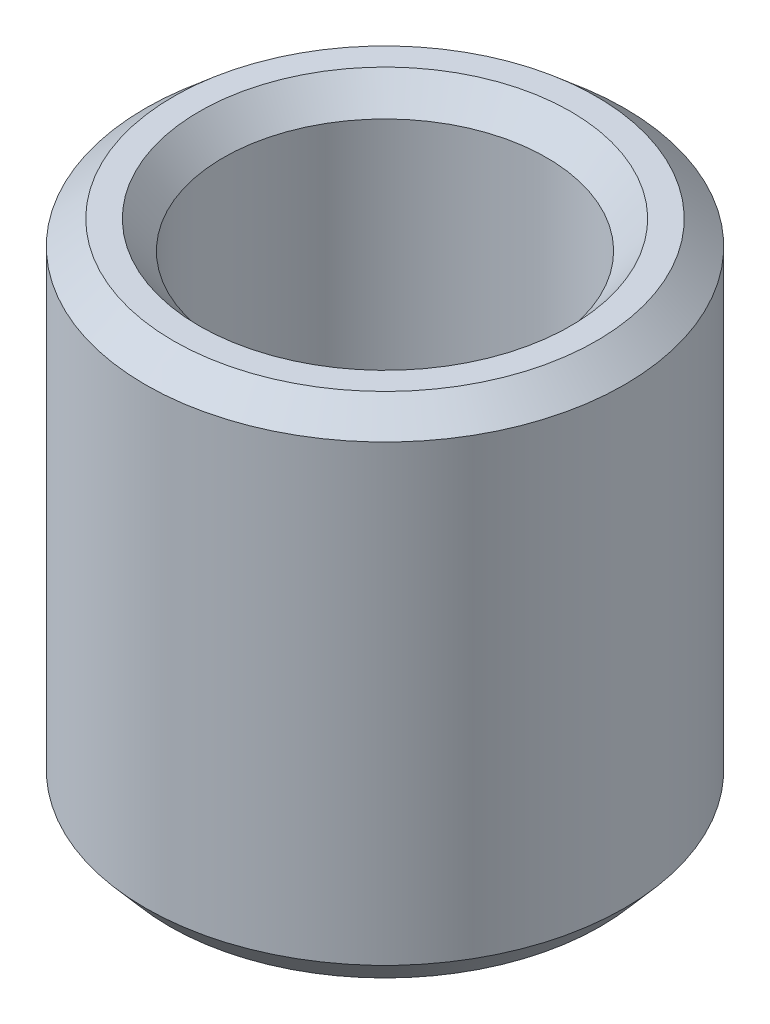
ISO-10303-21;
HEADER;
FILE_DESCRIPTION(('STEP AP214'),'2;1');
FILE_NAME('part.step','',(''),(''),'','','');
FILE_SCHEMA(('AUTOMOTIVE_DESIGN { 1 0 10303 214 1 1 1 1 }'));
ENDSEC;
DATA;
#1=APPLICATION_CONTEXT('core data for automotive mechanical design processes');
#2=APPLICATION_PROTOCOL_DEFINITION('international standard','automotive_design',2000,#1);
#3=PRODUCT_CONTEXT('',#1,'mechanical');
#4=PRODUCT('Part','Part','',(#3));
#5=PRODUCT_RELATED_PRODUCT_CATEGORY('part','',(#4));
#6=PRODUCT_DEFINITION_FORMATION('','',#4);
#7=PRODUCT_DEFINITION_CONTEXT('part definition',#1,'design');
#8=PRODUCT_DEFINITION('design','',#6,#7);
#9=PRODUCT_DEFINITION_SHAPE('','',#8);
#10=(LENGTH_UNIT() NAMED_UNIT(*) SI_UNIT(.MILLI.,.METRE.));
#11=(NAMED_UNIT(*) PLANE_ANGLE_UNIT() SI_UNIT($,.RADIAN.));
#12=(NAMED_UNIT(*) SI_UNIT($,.STERADIAN.) SOLID_ANGLE_UNIT());
#13=UNCERTAINTY_MEASURE_WITH_UNIT(LENGTH_MEASURE(1.E-05),#10,'distance_accuracy_value','');
#14=(GEOMETRIC_REPRESENTATION_CONTEXT(3) GLOBAL_UNCERTAINTY_ASSIGNED_CONTEXT((#13)) GLOBAL_UNIT_ASSIGNED_CONTEXT((#10,
#11,#12)) REPRESENTATION_CONTEXT('',''));
#15=CARTESIAN_POINT('',(0.,0.,0.));
#16=DIRECTION('',(0.,0.,1.));
#17=DIRECTION('',(1.,0.,0.));
#18=AXIS2_PLACEMENT_3D('',#15,#16,#17);
#19=CARTESIAN_POINT('',(0.,47.4583785047705,0.));
#20=DIRECTION('',(0.,-1.,0.));
#21=DIRECTION('',(0.,0.,-1.));
#22=AXIS2_PLACEMENT_3D('',#19,#20,#21);
#23=CYLINDRICAL_SURFACE('',#22,22.5);
#24=CARTESIAN_POINT('',(0.,2.62232727518268,0.));
#25=DIRECTION('',(0.,1.,0.));
#26=DIRECTION('',(0.,0.,1.));
#27=AXIS2_PLACEMENT_3D('',#24,#25,#26);
#28=CIRCLE('',#27,22.5);
#29=CARTESIAN_POINT('',(0.,2.62232727518268,22.5));
#30=VERTEX_POINT('',#29);
#31=EDGE_CURVE('E10',#30,#30,#28,.T.);
#32=ORIENTED_EDGE('',*,*,#31,.T.);
#33=EDGE_LOOP('',(#32));
#34=FACE_BOUND('',#33,.T.);
#35=CARTESIAN_POINT('',(0.,45.1979656897421,0.));
#36=DIRECTION('',(0.,1.,0.));
#37=DIRECTION('',(0.,0.,1.));
#38=AXIS2_PLACEMENT_3D('',#35,#36,#37);
#39=CIRCLE('',#38,22.5);
#40=CARTESIAN_POINT('',(0.,45.1979656897421,22.5));
#41=VERTEX_POINT('',#40);
#42=EDGE_CURVE('E50',#41,#41,#39,.F.);
#43=ORIENTED_EDGE('',*,*,#42,.T.);
#44=EDGE_LOOP('',(#43));
#45=FACE_BOUND('',#44,.T.);
#46=ADVANCED_FACE('F39',(#34,#45),#23,.T.);
#47=CARTESIAN_POINT('',(0.,47.4583785047705,0.));
#48=DIRECTION('',(0.,1.,0.));
#49=DIRECTION('',(0.,0.,1.));
#50=AXIS2_PLACEMENT_3D('',#47,#48,#49);
#51=PLANE('',#50);
#52=CARTESIAN_POINT('',(0.,47.4583785047705,0.));
#53=DIRECTION('',(0.,1.,0.));
#54=DIRECTION('',(0.,0.,1.));
#55=AXIS2_PLACEMENT_3D('',#52,#53,#54);
#56=CIRCLE('',#55,17.447491083797);
#57=CARTESIAN_POINT('',(0.,47.4583785047705,17.447491083797));
#58=VERTEX_POINT('',#57);
#59=EDGE_CURVE('E58',#58,#58,#56,.F.);
#60=ORIENTED_EDGE('',*,*,#59,.T.);
#61=EDGE_LOOP('',(#60));
#62=FACE_BOUND('',#61,.T.);
#63=CARTESIAN_POINT('',(0.,47.4583785047705,0.));
#64=DIRECTION('',(0.,1.,0.));
#65=DIRECTION('',(0.,0.,1.));
#66=AXIS2_PLACEMENT_3D('',#63,#64,#65);
#67=CIRCLE('',#66,19.8776727248173);
#68=CARTESIAN_POINT('',(0.,47.4583785047705,19.8776727248173));
#69=VERTEX_POINT('',#68);
#70=EDGE_CURVE('E61',#69,#69,#67,.T.);
#71=ORIENTED_EDGE('',*,*,#70,.T.);
#72=EDGE_LOOP('',(#71));
#73=FACE_BOUND('',#72,.T.);
#74=ADVANCED_FACE('F88',(#62,#73),#51,.T.);
#75=CARTESIAN_POINT('',(0.,0.,0.));
#76=DIRECTION('',(0.,1.,0.));
#77=DIRECTION('',(0.,0.,1.));
#78=AXIS2_PLACEMENT_3D('',#75,#76,#77);
#79=PLANE('',#78);
#80=CARTESIAN_POINT('',(0.,0.,0.));
#81=DIRECTION('',(0.,1.,0.));
#82=DIRECTION('',(0.,0.,1.));
#83=AXIS2_PLACEMENT_3D('',#80,#81,#82);
#84=CIRCLE('',#83,17.8094055439511);
#85=CARTESIAN_POINT('',(0.,0.,17.8094055439511));
#86=VERTEX_POINT('',#85);
#87=EDGE_CURVE('E51',#86,#86,#84,.T.);
#88=ORIENTED_EDGE('',*,*,#87,.T.);
#89=EDGE_LOOP('',(#88));
#90=FACE_BOUND('',#89,.T.);
#91=CARTESIAN_POINT('',(0.,0.,0.));
#92=DIRECTION('',(0.,1.,0.));
#93=DIRECTION('',(0.,0.,1.));
#94=AXIS2_PLACEMENT_3D('',#91,#92,#93);
#95=CIRCLE('',#94,20.2395871849715);
#96=CARTESIAN_POINT('',(0.,0.,20.2395871849715));
#97=VERTEX_POINT('',#96);
#98=EDGE_CURVE('E54',#97,#97,#95,.F.);
#99=ORIENTED_EDGE('',*,*,#98,.T.);
#100=EDGE_LOOP('',(#99));
#101=FACE_BOUND('',#100,.T.);
#102=ADVANCED_FACE('F83',(#90,#101),#79,.F.);
#103=CARTESIAN_POINT('',(0.,47.4583785047705,0.));
#104=DIRECTION('',(0.,-1.,0.));
#105=DIRECTION('',(0.,0.,-1.));
#106=AXIS2_PLACEMENT_3D('',#103,#104,#105);
#107=CYLINDRICAL_SURFACE('',#106,15.1870782687685);
#108=CARTESIAN_POINT('',(0.,44.8360512295878,0.));
#109=DIRECTION('',(0.,1.,0.));
#110=DIRECTION('',(0.,0.,1.));
#111=AXIS2_PLACEMENT_3D('',#108,#109,#110);
#112=CIRCLE('',#111,15.1870782687685);
#113=CARTESIAN_POINT('',(0.,44.8360512295878,15.1870782687685));
#114=VERTEX_POINT('',#113);
#115=EDGE_CURVE('E67',#114,#114,#112,.T.);
#116=ORIENTED_EDGE('',*,*,#115,.T.);
#117=EDGE_LOOP('',(#116));
#118=FACE_BOUND('',#117,.T.);
#119=CARTESIAN_POINT('',(0.,2.26041281502846,0.));
#120=DIRECTION('',(0.,1.,0.));
#121=DIRECTION('',(0.,0.,1.));
#122=AXIS2_PLACEMENT_3D('',#119,#120,#121);
#123=CIRCLE('',#122,15.1870782687685);
#124=CARTESIAN_POINT('',(0.,2.26041281502846,15.1870782687685));
#125=VERTEX_POINT('',#124);
#126=EDGE_CURVE('E69',#125,#125,#123,.F.);
#127=ORIENTED_EDGE('',*,*,#126,.T.);
#128=EDGE_LOOP('',(#127));
#129=FACE_BOUND('',#128,.T.);
#130=ADVANCED_FACE('F71',(#118,#129),#107,.F.);
#131=CARTESIAN_POINT('',(0.,44.8360512295878,0.));
#132=DIRECTION('',(0.,1.,0.));
#133=DIRECTION('',(0.,0.,1.));
#134=AXIS2_PLACEMENT_3D('',#131,#132,#133);
#135=CONICAL_SURFACE('',#134,15.1870782687685,0.711412276416384);
#136=ORIENTED_EDGE('',*,*,#59,.F.);
#137=EDGE_LOOP('',(#136));
#138=FACE_BOUND('',#137,.T.);
#139=ORIENTED_EDGE('',*,*,#115,.F.);
#140=EDGE_LOOP('',(#139));
#141=FACE_BOUND('',#140,.T.);
#142=ADVANCED_FACE('F77',(#138,#141),#135,.F.);
#143=CARTESIAN_POINT('',(0.,0.,0.));
#144=DIRECTION('',(0.,-1.,0.));
#145=DIRECTION('',(0.,0.,-1.));
#146=AXIS2_PLACEMENT_3D('',#143,#144,#145);
#147=CONICAL_SURFACE('',#146,17.8094055439511,0.859384050378512);
#148=ORIENTED_EDGE('',*,*,#126,.F.);
#149=EDGE_LOOP('',(#148));
#150=FACE_BOUND('',#149,.T.);
#151=ORIENTED_EDGE('',*,*,#87,.F.);
#152=EDGE_LOOP('',(#151));
#153=FACE_BOUND('',#152,.T.);
#154=ADVANCED_FACE('F73',(#150,#153),#147,.F.);
#155=CARTESIAN_POINT('',(0.,2.62232727518268,0.));
#156=DIRECTION('',(0.,1.,0.));
#157=DIRECTION('',(0.,0.,1.));
#158=AXIS2_PLACEMENT_3D('',#155,#156,#157);
#159=CONICAL_SURFACE('',#158,22.5,0.711412276416386);
#160=ORIENTED_EDGE('',*,*,#98,.F.);
#161=EDGE_LOOP('',(#160));
#162=FACE_BOUND('',#161,.T.);
#163=ORIENTED_EDGE('',*,*,#31,.F.);
#164=EDGE_LOOP('',(#163));
#165=FACE_BOUND('',#164,.T.);
#166=ADVANCED_FACE('F76',(#162,#165),#159,.T.);
#167=CARTESIAN_POINT('',(0.,47.4583785047705,0.));
#168=DIRECTION('',(0.,-1.,0.));
#169=DIRECTION('',(0.,0.,-1.));
#170=AXIS2_PLACEMENT_3D('',#167,#168,#169);
#171=CONICAL_SURFACE('',#170,19.8776727248173,0.859384050378515);
#172=ORIENTED_EDGE('',*,*,#42,.F.);
#173=EDGE_LOOP('',(#172));
#174=FACE_BOUND('',#173,.T.);
#175=ORIENTED_EDGE('',*,*,#70,.F.);
#176=EDGE_LOOP('',(#175));
#177=FACE_BOUND('',#176,.T.);
#178=ADVANCED_FACE('F45',(#174,#177),#171,.T.);
#179=CLOSED_SHELL('',(#46,#74,#102,#130,#142,#154,#166,#178));
#180=MANIFOLD_SOLID_BREP('B2',#179);
#181=ADVANCED_BREP_SHAPE_REPRESENTATION('',(#18,#180),#14);
#182=SHAPE_DEFINITION_REPRESENTATION(#9,#181);
ENDSEC;
END-ISO-10303-21;
